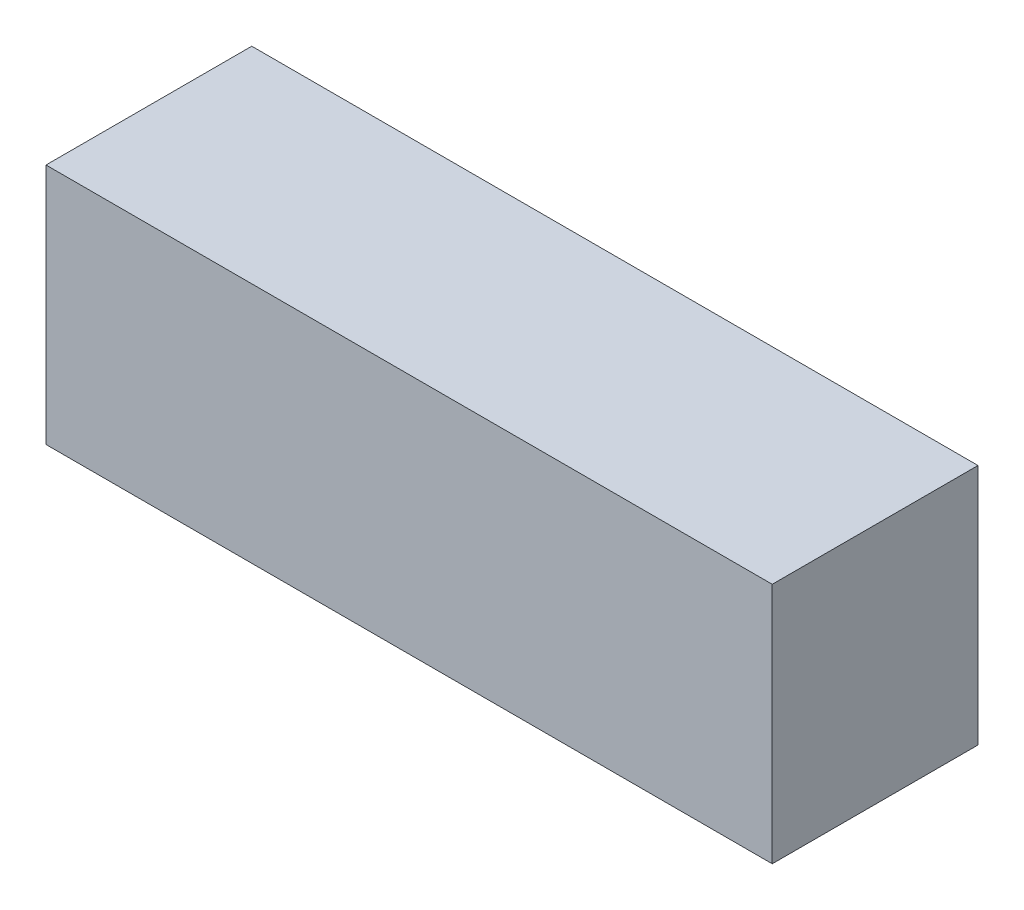
ISO-10303-21;
HEADER;
FILE_DESCRIPTION(('STEP AP214'),'2;1');
FILE_NAME('part.step','',(''),(''),'','','');
FILE_SCHEMA(('AUTOMOTIVE_DESIGN { 1 0 10303 214 1 1 1 1 }'));
ENDSEC;
DATA;
#1=APPLICATION_CONTEXT('core data for automotive mechanical design processes');
#2=APPLICATION_PROTOCOL_DEFINITION('international standard','automotive_design',2000,#1);
#3=PRODUCT_CONTEXT('',#1,'mechanical');
#4=PRODUCT('Part','Part','',(#3));
#5=PRODUCT_RELATED_PRODUCT_CATEGORY('part','',(#4));
#6=PRODUCT_DEFINITION_FORMATION('','',#4);
#7=PRODUCT_DEFINITION_CONTEXT('part definition',#1,'design');
#8=PRODUCT_DEFINITION('design','',#6,#7);
#9=PRODUCT_DEFINITION_SHAPE('','',#8);
#10=(LENGTH_UNIT() NAMED_UNIT(*) SI_UNIT(.MILLI.,.METRE.));
#11=(NAMED_UNIT(*) PLANE_ANGLE_UNIT() SI_UNIT($,.RADIAN.));
#12=(NAMED_UNIT(*) SI_UNIT($,.STERADIAN.) SOLID_ANGLE_UNIT());
#13=UNCERTAINTY_MEASURE_WITH_UNIT(LENGTH_MEASURE(1.E-05),#10,'distance_accuracy_value','');
#14=(GEOMETRIC_REPRESENTATION_CONTEXT(3) GLOBAL_UNCERTAINTY_ASSIGNED_CONTEXT((#13)) GLOBAL_UNIT_ASSIGNED_CONTEXT((#10,
#11,#12)) REPRESENTATION_CONTEXT('',''));
#15=CARTESIAN_POINT('',(0.,0.,0.));
#16=DIRECTION('',(0.,0.,1.));
#17=DIRECTION('',(1.,0.,0.));
#18=AXIS2_PLACEMENT_3D('',#15,#16,#17);
#19=CARTESIAN_POINT('',(30.,20.,-8.5));
#20=DIRECTION('',(-1.,0.,0.));
#21=DIRECTION('',(0.,0.,1.));
#22=AXIS2_PLACEMENT_3D('',#19,#20,#21);
#23=PLANE('',#22);
#24=DIRECTION('',(0.,0.,-1.));
#25=VECTOR('',#24,1.);
#26=CARTESIAN_POINT('',(30.,0.,-8.5));
#27=LINE('',#26,#25);
#28=CARTESIAN_POINT('',(30.,0.,8.5));
#29=VERTEX_POINT('',#28);
#30=CARTESIAN_POINT('',(30.,0.,-8.5));
#31=VERTEX_POINT('',#30);
#32=EDGE_CURVE('E113',#29,#31,#27,.T.);
#33=ORIENTED_EDGE('',*,*,#32,.T.);
#34=DIRECTION('',(0.,-1.,0.));
#35=VECTOR('',#34,1.);
#36=CARTESIAN_POINT('',(30.,20.,-8.5));
#37=LINE('',#36,#35);
#38=CARTESIAN_POINT('',(30.,20.,-8.5));
#39=VERTEX_POINT('',#38);
#40=EDGE_CURVE('E11',#39,#31,#37,.T.);
#41=ORIENTED_EDGE('',*,*,#40,.F.);
#42=DIRECTION('',(0.,0.,-1.));
#43=VECTOR('',#42,1.);
#44=CARTESIAN_POINT('',(30.,20.,-8.5));
#45=LINE('',#44,#43);
#46=CARTESIAN_POINT('',(30.,20.,8.5));
#47=VERTEX_POINT('',#46);
#48=EDGE_CURVE('E97',#47,#39,#45,.T.);
#49=ORIENTED_EDGE('',*,*,#48,.F.);
#50=DIRECTION('',(0.,-1.,0.));
#51=VECTOR('',#50,1.);
#52=CARTESIAN_POINT('',(30.,20.,8.5));
#53=LINE('',#52,#51);
#54=EDGE_CURVE('E109',#47,#29,#53,.T.);
#55=ORIENTED_EDGE('',*,*,#54,.T.);
#56=EDGE_LOOP('',(#33,#41,#49,#55));
#57=FACE_BOUND('',#56,.T.);
#58=ADVANCED_FACE('F45',(#57),#23,.F.);
#59=CARTESIAN_POINT('',(-30.,20.,-8.5));
#60=DIRECTION('',(0.,0.,1.));
#61=DIRECTION('',(1.,0.,0.));
#62=AXIS2_PLACEMENT_3D('',#59,#60,#61);
#63=PLANE('',#62);
#64=DIRECTION('',(-1.,0.,0.));
#65=VECTOR('',#64,1.);
#66=CARTESIAN_POINT('',(-30.,0.,-8.5));
#67=LINE('',#66,#65);
#68=CARTESIAN_POINT('',(-30.,0.,-8.5));
#69=VERTEX_POINT('',#68);
#70=EDGE_CURVE('E102',#31,#69,#67,.T.);
#71=ORIENTED_EDGE('',*,*,#70,.T.);
#72=DIRECTION('',(0.,-1.,0.));
#73=VECTOR('',#72,1.);
#74=CARTESIAN_POINT('',(-30.,20.,-8.5));
#75=LINE('',#74,#73);
#76=CARTESIAN_POINT('',(-30.,20.,-8.5));
#77=VERTEX_POINT('',#76);
#78=EDGE_CURVE('E54',#77,#69,#75,.T.);
#79=ORIENTED_EDGE('',*,*,#78,.F.);
#80=DIRECTION('',(-1.,0.,0.));
#81=VECTOR('',#80,1.);
#82=CARTESIAN_POINT('',(-30.,20.,-8.5));
#83=LINE('',#82,#81);
#84=EDGE_CURVE('E92',#39,#77,#83,.T.);
#85=ORIENTED_EDGE('',*,*,#84,.F.);
#86=ORIENTED_EDGE('',*,*,#40,.T.);
#87=EDGE_LOOP('',(#71,#79,#85,#86));
#88=FACE_BOUND('',#87,.T.);
#89=ADVANCED_FACE('F101',(#88),#63,.F.);
#90=CARTESIAN_POINT('',(-30.,20.,-8.5));
#91=DIRECTION('',(1.,0.,0.));
#92=DIRECTION('',(0.,0.,-1.));
#93=AXIS2_PLACEMENT_3D('',#90,#91,#92);
#94=PLANE('',#93);
#95=DIRECTION('',(0.,0.,1.));
#96=VECTOR('',#95,1.);
#97=CARTESIAN_POINT('',(-30.,0.,-8.5));
#98=LINE('',#97,#96);
#99=CARTESIAN_POINT('',(-30.,0.,8.5));
#100=VERTEX_POINT('',#99);
#101=EDGE_CURVE('E79',#69,#100,#98,.T.);
#102=ORIENTED_EDGE('',*,*,#101,.T.);
#103=DIRECTION('',(0.,-1.,0.));
#104=VECTOR('',#103,1.);
#105=CARTESIAN_POINT('',(-30.,20.,8.5));
#106=LINE('',#105,#104);
#107=CARTESIAN_POINT('',(-30.,20.,8.5));
#108=VERTEX_POINT('',#107);
#109=EDGE_CURVE('E104',#108,#100,#106,.T.);
#110=ORIENTED_EDGE('',*,*,#109,.F.);
#111=DIRECTION('',(0.,0.,1.));
#112=VECTOR('',#111,1.);
#113=CARTESIAN_POINT('',(-30.,20.,-8.5));
#114=LINE('',#113,#112);
#115=EDGE_CURVE('E95',#77,#108,#114,.T.);
#116=ORIENTED_EDGE('',*,*,#115,.F.);
#117=ORIENTED_EDGE('',*,*,#78,.T.);
#118=EDGE_LOOP('',(#102,#110,#116,#117));
#119=FACE_BOUND('',#118,.T.);
#120=ADVANCED_FACE('F105',(#119),#94,.F.);
#121=CARTESIAN_POINT('',(-30.,20.,8.5));
#122=DIRECTION('',(0.,0.,-1.));
#123=DIRECTION('',(-1.,0.,0.));
#124=AXIS2_PLACEMENT_3D('',#121,#122,#123);
#125=PLANE('',#124);
#126=DIRECTION('',(1.,0.,0.));
#127=VECTOR('',#126,1.);
#128=CARTESIAN_POINT('',(-30.,0.,8.5));
#129=LINE('',#128,#127);
#130=EDGE_CURVE('E85',#100,#29,#129,.T.);
#131=ORIENTED_EDGE('',*,*,#130,.T.);
#132=ORIENTED_EDGE('',*,*,#54,.F.);
#133=DIRECTION('',(1.,0.,0.));
#134=VECTOR('',#133,1.);
#135=CARTESIAN_POINT('',(-30.,20.,8.5));
#136=LINE('',#135,#134);
#137=EDGE_CURVE('E62',#108,#47,#136,.T.);
#138=ORIENTED_EDGE('',*,*,#137,.F.);
#139=ORIENTED_EDGE('',*,*,#109,.T.);
#140=EDGE_LOOP('',(#131,#132,#138,#139));
#141=FACE_BOUND('',#140,.T.);
#142=ADVANCED_FACE('F126',(#141),#125,.F.);
#143=CARTESIAN_POINT('',(0.,20.,0.));
#144=DIRECTION('',(0.,1.,0.));
#145=DIRECTION('',(0.,0.,1.));
#146=AXIS2_PLACEMENT_3D('',#143,#144,#145);
#147=PLANE('',#146);
#148=ORIENTED_EDGE('',*,*,#48,.T.);
#149=ORIENTED_EDGE('',*,*,#84,.T.);
#150=ORIENTED_EDGE('',*,*,#115,.T.);
#151=ORIENTED_EDGE('',*,*,#137,.T.);
#152=EDGE_LOOP('',(#148,#149,#150,#151));
#153=FACE_BOUND('',#152,.T.);
#154=ADVANCED_FACE('F93',(#153),#147,.T.);
#155=CARTESIAN_POINT('',(0.,0.,0.));
#156=DIRECTION('',(0.,1.,0.));
#157=DIRECTION('',(0.,0.,1.));
#158=AXIS2_PLACEMENT_3D('',#155,#156,#157);
#159=PLANE('',#158);
#160=ORIENTED_EDGE('',*,*,#32,.F.);
#161=ORIENTED_EDGE('',*,*,#130,.F.);
#162=ORIENTED_EDGE('',*,*,#101,.F.);
#163=ORIENTED_EDGE('',*,*,#70,.F.);
#164=EDGE_LOOP('',(#160,#161,#162,#163));
#165=FACE_BOUND('',#164,.T.);
#166=ADVANCED_FACE('F129',(#165),#159,.F.);
#167=CLOSED_SHELL('',(#58,#89,#120,#142,#154,#166));
#168=MANIFOLD_SOLID_BREP('B2',#167);
#169=ADVANCED_BREP_SHAPE_REPRESENTATION('',(#18,#168),#14);
#170=SHAPE_DEFINITION_REPRESENTATION(#9,#169);
ENDSEC;
END-ISO-10303-21;
